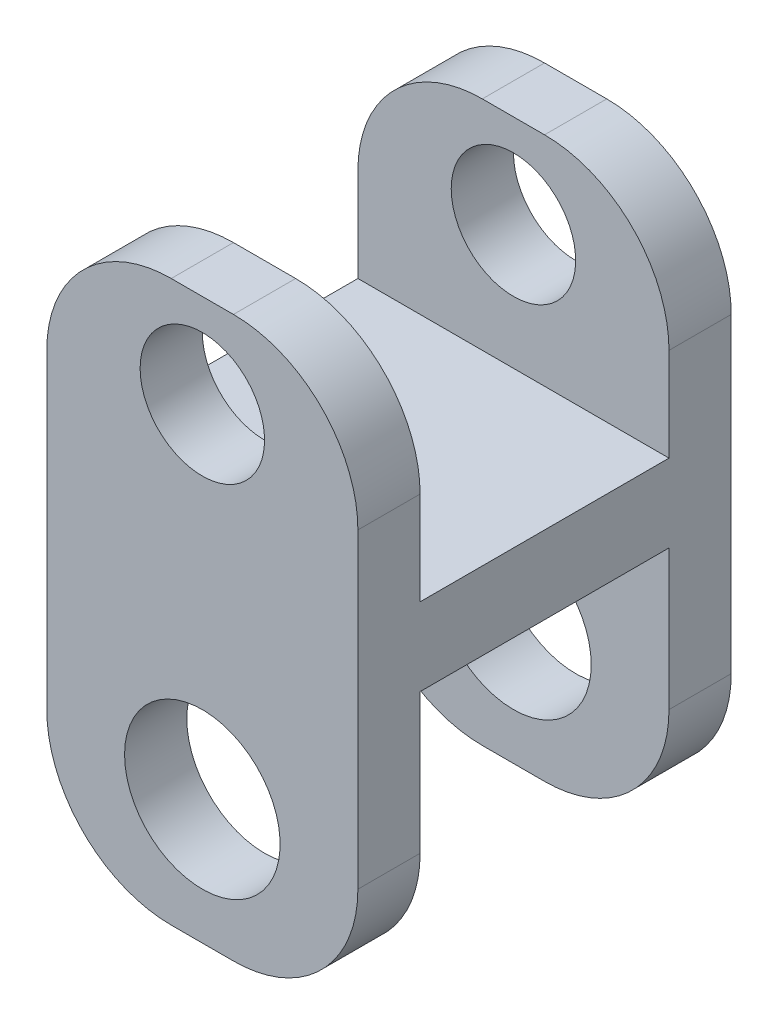
ISO-10303-21;
HEADER;
FILE_DESCRIPTION(('STEP AP214'),'2;1');
FILE_NAME('part.step','',(''),(''),'','','');
FILE_SCHEMA(('AUTOMOTIVE_DESIGN { 1 0 10303 214 1 1 1 1 }'));
ENDSEC;
DATA;
#1=APPLICATION_CONTEXT('core data for automotive mechanical design processes');
#2=APPLICATION_PROTOCOL_DEFINITION('international standard','automotive_design',2000,#1);
#3=PRODUCT_CONTEXT('',#1,'mechanical');
#4=PRODUCT('Part','Part','',(#3));
#5=PRODUCT_RELATED_PRODUCT_CATEGORY('part','',(#4));
#6=PRODUCT_DEFINITION_FORMATION('','',#4);
#7=PRODUCT_DEFINITION_CONTEXT('part definition',#1,'design');
#8=PRODUCT_DEFINITION('design','',#6,#7);
#9=PRODUCT_DEFINITION_SHAPE('','',#8);
#10=(LENGTH_UNIT() NAMED_UNIT(*) SI_UNIT(.MILLI.,.METRE.));
#11=(NAMED_UNIT(*) PLANE_ANGLE_UNIT() SI_UNIT($,.RADIAN.));
#12=(NAMED_UNIT(*) SI_UNIT($,.STERADIAN.) SOLID_ANGLE_UNIT());
#13=UNCERTAINTY_MEASURE_WITH_UNIT(LENGTH_MEASURE(1.E-05),#10,'distance_accuracy_value','');
#14=(GEOMETRIC_REPRESENTATION_CONTEXT(3) GLOBAL_UNCERTAINTY_ASSIGNED_CONTEXT((#13)) GLOBAL_UNIT_ASSIGNED_CONTEXT((#10,
#11,#12)) REPRESENTATION_CONTEXT('',''));
#15=CARTESIAN_POINT('',(0.,0.,0.));
#16=DIRECTION('',(0.,0.,1.));
#17=DIRECTION('',(1.,0.,0.));
#18=AXIS2_PLACEMENT_3D('',#15,#16,#17);
#19=CARTESIAN_POINT('',(5.,-9.,-6.));
#20=DIRECTION('',(0.,0.,1.));
#21=DIRECTION('',(1.,0.,0.));
#22=AXIS2_PLACEMENT_3D('',#19,#20,#21);
#23=PLANE('',#22);
#24=CARTESIAN_POINT('',(0.,6.,-6.));
#25=DIRECTION('',(0.,0.,-1.));
#26=DIRECTION('',(-1.,0.,0.));
#27=AXIS2_PLACEMENT_3D('',#24,#25,#26);
#28=CIRCLE('',#27,2.);
#29=CARTESIAN_POINT('',(-2.,6.,-6.));
#30=VERTEX_POINT('',#29);
#31=EDGE_CURVE('E446',#30,#30,#28,.T.);
#32=ORIENTED_EDGE('',*,*,#31,.F.);
#33=EDGE_LOOP('',(#32));
#34=FACE_BOUND('',#33,.T.);
#35=CARTESIAN_POINT('',(0.,-5.,-6.));
#36=DIRECTION('',(0.,0.,-1.));
#37=DIRECTION('',(-1.,0.,0.));
#38=AXIS2_PLACEMENT_3D('',#35,#36,#37);
#39=CIRCLE('',#38,2.5);
#40=CARTESIAN_POINT('',(-2.5,-5.,-6.));
#41=VERTEX_POINT('',#40);
#42=EDGE_CURVE('E438',#41,#41,#39,.T.);
#43=ORIENTED_EDGE('',*,*,#42,.F.);
#44=EDGE_LOOP('',(#43));
#45=FACE_BOUND('',#44,.T.);
#46=DIRECTION('',(0.,1.,0.));
#47=VECTOR('',#46,1.);
#48=CARTESIAN_POINT('',(-5.,-9.,-6.));
#49=LINE('',#48,#47);
#50=CARTESIAN_POINT('',(-5.,-5.,-6.));
#51=VERTEX_POINT('',#50);
#52=CARTESIAN_POINT('',(-5.,5.,-6.));
#53=VERTEX_POINT('',#52);
#54=EDGE_CURVE('E228',#51,#53,#49,.T.);
#55=ORIENTED_EDGE('',*,*,#54,.T.);
#56=CARTESIAN_POINT('',(-1.,5.,-6.));
#57=DIRECTION('',(0.,0.,1.));
#58=DIRECTION('',(1.,0.,0.));
#59=AXIS2_PLACEMENT_3D('',#56,#57,#58);
#60=CIRCLE('',#59,4.);
#61=CARTESIAN_POINT('',(-1.,9.,-6.));
#62=VERTEX_POINT('',#61);
#63=EDGE_CURVE('E358',#53,#62,#60,.F.);
#64=ORIENTED_EDGE('',*,*,#63,.T.);
#65=DIRECTION('',(-1.,0.,0.));
#66=VECTOR('',#65,1.);
#67=CARTESIAN_POINT('',(5.,9.,-6.));
#68=LINE('',#67,#66);
#69=CARTESIAN_POINT('',(1.,9.,-6.));
#70=VERTEX_POINT('',#69);
#71=EDGE_CURVE('E289',#70,#62,#68,.T.);
#72=ORIENTED_EDGE('',*,*,#71,.F.);
#73=CARTESIAN_POINT('',(1.,5.,-6.));
#74=DIRECTION('',(0.,0.,1.));
#75=DIRECTION('',(1.,0.,0.));
#76=AXIS2_PLACEMENT_3D('',#73,#74,#75);
#77=CIRCLE('',#76,4.);
#78=CARTESIAN_POINT('',(5.,5.,-6.));
#79=VERTEX_POINT('',#78);
#80=EDGE_CURVE('E355',#70,#79,#77,.F.);
#81=ORIENTED_EDGE('',*,*,#80,.T.);
#82=DIRECTION('',(0.,1.,0.));
#83=VECTOR('',#82,1.);
#84=CARTESIAN_POINT('',(5.,-9.,-6.));
#85=LINE('',#84,#83);
#86=CARTESIAN_POINT('',(5.,-5.,-6.));
#87=VERTEX_POINT('',#86);
#88=EDGE_CURVE('E189',#87,#79,#85,.T.);
#89=ORIENTED_EDGE('',*,*,#88,.F.);
#90=CARTESIAN_POINT('',(1.,-5.,-6.));
#91=DIRECTION('',(0.,0.,1.));
#92=DIRECTION('',(1.,0.,0.));
#93=AXIS2_PLACEMENT_3D('',#90,#91,#92);
#94=CIRCLE('',#93,4.);
#95=CARTESIAN_POINT('',(1.,-9.,-6.));
#96=VERTEX_POINT('',#95);
#97=EDGE_CURVE('E349',#87,#96,#94,.F.);
#98=ORIENTED_EDGE('',*,*,#97,.T.);
#99=DIRECTION('',(-1.,0.,0.));
#100=VECTOR('',#99,1.);
#101=CARTESIAN_POINT('',(5.,-9.,-6.));
#102=LINE('',#101,#100);
#103=CARTESIAN_POINT('',(-1.,-9.,-6.));
#104=VERTEX_POINT('',#103);
#105=EDGE_CURVE('E227',#96,#104,#102,.T.);
#106=ORIENTED_EDGE('',*,*,#105,.T.);
#107=CARTESIAN_POINT('',(-1.,-5.,-6.));
#108=DIRECTION('',(0.,0.,1.));
#109=DIRECTION('',(1.,0.,0.));
#110=AXIS2_PLACEMENT_3D('',#107,#108,#109);
#111=CIRCLE('',#110,4.);
#112=EDGE_CURVE('E352',#104,#51,#111,.F.);
#113=ORIENTED_EDGE('',*,*,#112,.T.);
#114=EDGE_LOOP('',(#55,#64,#72,#81,#89,#98,#106,#113));
#115=FACE_BOUND('',#114,.T.);
#116=ADVANCED_FACE('F39',(#34,#45,#115),#23,.F.);
#117=CARTESIAN_POINT('',(5.,9.,-4.));
#118=DIRECTION('',(0.,-1.,0.));
#119=DIRECTION('',(0.,0.,-1.));
#120=AXIS2_PLACEMENT_3D('',#117,#118,#119);
#121=PLANE('',#120);
#122=ORIENTED_EDGE('',*,*,#71,.T.);
#123=DIRECTION('',(0.,0.,1.));
#124=VECTOR('',#123,1.);
#125=CARTESIAN_POINT('',(-1.,9.,-4.));
#126=LINE('',#125,#124);
#127=CARTESIAN_POINT('',(-1.,9.,-4.));
#128=VERTEX_POINT('',#127);
#129=EDGE_CURVE('E339',#62,#128,#126,.T.);
#130=ORIENTED_EDGE('',*,*,#129,.T.);
#131=DIRECTION('',(-1.,0.,0.));
#132=VECTOR('',#131,1.);
#133=CARTESIAN_POINT('',(5.,9.,-4.));
#134=LINE('',#133,#132);
#135=CARTESIAN_POINT('',(1.,9.,-4.));
#136=VERTEX_POINT('',#135);
#137=EDGE_CURVE('E200',#136,#128,#134,.T.);
#138=ORIENTED_EDGE('',*,*,#137,.F.);
#139=DIRECTION('',(0.,0.,1.));
#140=VECTOR('',#139,1.);
#141=CARTESIAN_POINT('',(1.,9.,-4.));
#142=LINE('',#141,#140);
#143=EDGE_CURVE('E336',#136,#70,#142,.F.);
#144=ORIENTED_EDGE('',*,*,#143,.T.);
#145=EDGE_LOOP('',(#122,#130,#138,#144));
#146=FACE_BOUND('',#145,.T.);
#147=ADVANCED_FACE('F421',(#146),#121,.F.);
#148=CARTESIAN_POINT('',(5.,9.,-4.));
#149=DIRECTION('',(0.,0.,-1.));
#150=DIRECTION('',(0.,1.,0.));
#151=AXIS2_PLACEMENT_3D('',#148,#149,#150);
#152=PLANE('',#151);
#153=CARTESIAN_POINT('',(0.,6.,-4.));
#154=DIRECTION('',(0.,0.,-1.));
#155=DIRECTION('',(0.,1.,0.));
#156=AXIS2_PLACEMENT_3D('',#153,#154,#155);
#157=CIRCLE('',#156,2.);
#158=CARTESIAN_POINT('',(0.,8.,-4.));
#159=VERTEX_POINT('',#158);
#160=EDGE_CURVE('E232',#159,#159,#157,.T.);
#161=ORIENTED_EDGE('',*,*,#160,.T.);
#162=EDGE_LOOP('',(#161));
#163=FACE_BOUND('',#162,.T.);
#164=ORIENTED_EDGE('',*,*,#137,.T.);
#165=CARTESIAN_POINT('',(-1.,5.,-4.));
#166=DIRECTION('',(0.,0.,-1.));
#167=DIRECTION('',(0.,1.,0.));
#168=AXIS2_PLACEMENT_3D('',#165,#166,#167);
#169=CIRCLE('',#168,4.);
#170=CARTESIAN_POINT('',(-5.,5.,-4.));
#171=VERTEX_POINT('',#170);
#172=EDGE_CURVE('E346',#128,#171,#169,.F.);
#173=ORIENTED_EDGE('',*,*,#172,.T.);
#174=DIRECTION('',(0.,-1.,0.));
#175=VECTOR('',#174,1.);
#176=CARTESIAN_POINT('',(-5.,9.,-4.));
#177=LINE('',#176,#175);
#178=CARTESIAN_POINT('',(-5.,2.,-4.));
#179=VERTEX_POINT('',#178);
#180=EDGE_CURVE('E196',#171,#179,#177,.T.);
#181=ORIENTED_EDGE('',*,*,#180,.T.);
#182=DIRECTION('',(-1.,0.,0.));
#183=VECTOR('',#182,1.);
#184=CARTESIAN_POINT('',(5.,2.,-4.));
#185=LINE('',#184,#183);
#186=CARTESIAN_POINT('',(5.,2.,-4.));
#187=VERTEX_POINT('',#186);
#188=EDGE_CURVE('E192',#187,#179,#185,.T.);
#189=ORIENTED_EDGE('',*,*,#188,.F.);
#190=DIRECTION('',(0.,-1.,0.));
#191=VECTOR('',#190,1.);
#192=CARTESIAN_POINT('',(5.,9.,-4.));
#193=LINE('',#192,#191);
#194=CARTESIAN_POINT('',(5.,5.,-4.));
#195=VERTEX_POINT('',#194);
#196=EDGE_CURVE('E177',#195,#187,#193,.T.);
#197=ORIENTED_EDGE('',*,*,#196,.F.);
#198=CARTESIAN_POINT('',(1.,5.,-4.));
#199=DIRECTION('',(0.,0.,-1.));
#200=DIRECTION('',(0.,1.,0.));
#201=AXIS2_PLACEMENT_3D('',#198,#199,#200);
#202=CIRCLE('',#201,4.);
#203=EDGE_CURVE('E343',#195,#136,#202,.F.);
#204=ORIENTED_EDGE('',*,*,#203,.T.);
#205=EDGE_LOOP('',(#164,#173,#181,#189,#197,#204));
#206=FACE_BOUND('',#205,.T.);
#207=ADVANCED_FACE('F194',(#163,#206),#152,.F.);
#208=CARTESIAN_POINT('',(5.,2.,4.));
#209=DIRECTION('',(0.,-1.,0.));
#210=DIRECTION('',(0.,0.,-1.));
#211=AXIS2_PLACEMENT_3D('',#208,#209,#210);
#212=PLANE('',#211);
#213=DIRECTION('',(0.,0.,1.));
#214=VECTOR('',#213,1.);
#215=CARTESIAN_POINT('',(-5.,2.,4.));
#216=LINE('',#215,#214);
#217=CARTESIAN_POINT('',(-5.,2.,4.));
#218=VERTEX_POINT('',#217);
#219=EDGE_CURVE('E235',#179,#218,#216,.T.);
#220=ORIENTED_EDGE('',*,*,#219,.T.);
#221=DIRECTION('',(-1.,0.,0.));
#222=VECTOR('',#221,1.);
#223=CARTESIAN_POINT('',(5.,2.,4.));
#224=LINE('',#223,#222);
#225=CARTESIAN_POINT('',(5.,2.,4.));
#226=VERTEX_POINT('',#225);
#227=EDGE_CURVE('E201',#226,#218,#224,.T.);
#228=ORIENTED_EDGE('',*,*,#227,.F.);
#229=DIRECTION('',(0.,0.,1.));
#230=VECTOR('',#229,1.);
#231=CARTESIAN_POINT('',(5.,2.,4.));
#232=LINE('',#231,#230);
#233=EDGE_CURVE('E182',#187,#226,#232,.T.);
#234=ORIENTED_EDGE('',*,*,#233,.F.);
#235=ORIENTED_EDGE('',*,*,#188,.T.);
#236=EDGE_LOOP('',(#220,#228,#234,#235));
#237=FACE_BOUND('',#236,.T.);
#238=ADVANCED_FACE('F203',(#237),#212,.F.);
#239=CARTESIAN_POINT('',(5.,9.,4.));
#240=DIRECTION('',(0.,0.,1.));
#241=DIRECTION('',(0.,-1.,0.));
#242=AXIS2_PLACEMENT_3D('',#239,#240,#241);
#243=PLANE('',#242);
#244=CARTESIAN_POINT('',(0.,6.,4.));
#245=DIRECTION('',(0.,0.,1.));
#246=DIRECTION('',(0.,-1.,0.));
#247=AXIS2_PLACEMENT_3D('',#244,#245,#246);
#248=CIRCLE('',#247,2.);
#249=CARTESIAN_POINT('',(0.,4.,4.));
#250=VERTEX_POINT('',#249);
#251=EDGE_CURVE('E431',#250,#250,#248,.T.);
#252=ORIENTED_EDGE('',*,*,#251,.T.);
#253=EDGE_LOOP('',(#252));
#254=FACE_BOUND('',#253,.T.);
#255=DIRECTION('',(0.,1.,0.));
#256=VECTOR('',#255,1.);
#257=CARTESIAN_POINT('',(-5.,9.,4.));
#258=LINE('',#257,#256);
#259=CARTESIAN_POINT('',(-5.,5.,4.));
#260=VERTEX_POINT('',#259);
#261=EDGE_CURVE('E238',#218,#260,#258,.T.);
#262=ORIENTED_EDGE('',*,*,#261,.T.);
#263=CARTESIAN_POINT('',(-1.,5.,4.));
#264=DIRECTION('',(0.,0.,1.));
#265=DIRECTION('',(0.,-1.,0.));
#266=AXIS2_PLACEMENT_3D('',#263,#264,#265);
#267=CIRCLE('',#266,4.);
#268=CARTESIAN_POINT('',(-1.,9.,4.));
#269=VERTEX_POINT('',#268);
#270=EDGE_CURVE('E333',#260,#269,#267,.F.);
#271=ORIENTED_EDGE('',*,*,#270,.T.);
#272=DIRECTION('',(-1.,0.,0.));
#273=VECTOR('',#272,1.);
#274=CARTESIAN_POINT('',(5.,9.,4.));
#275=LINE('',#274,#273);
#276=CARTESIAN_POINT('',(1.,9.,4.));
#277=VERTEX_POINT('',#276);
#278=EDGE_CURVE('E281',#277,#269,#275,.T.);
#279=ORIENTED_EDGE('',*,*,#278,.F.);
#280=CARTESIAN_POINT('',(1.,5.,4.));
#281=DIRECTION('',(0.,0.,1.));
#282=DIRECTION('',(0.,-1.,0.));
#283=AXIS2_PLACEMENT_3D('',#280,#281,#282);
#284=CIRCLE('',#283,4.);
#285=CARTESIAN_POINT('',(5.,5.,4.));
#286=VERTEX_POINT('',#285);
#287=EDGE_CURVE('E330',#277,#286,#284,.F.);
#288=ORIENTED_EDGE('',*,*,#287,.T.);
#289=DIRECTION('',(0.,1.,0.));
#290=VECTOR('',#289,1.);
#291=CARTESIAN_POINT('',(5.,9.,4.));
#292=LINE('',#291,#290);
#293=EDGE_CURVE('E207',#226,#286,#292,.T.);
#294=ORIENTED_EDGE('',*,*,#293,.F.);
#295=ORIENTED_EDGE('',*,*,#227,.T.);
#296=EDGE_LOOP('',(#262,#271,#279,#288,#294,#295));
#297=FACE_BOUND('',#296,.T.);
#298=ADVANCED_FACE('F465',(#254,#297),#243,.F.);
#299=CARTESIAN_POINT('',(5.,9.,6.));
#300=DIRECTION('',(0.,-1.,0.));
#301=DIRECTION('',(0.,0.,-1.));
#302=AXIS2_PLACEMENT_3D('',#299,#300,#301);
#303=PLANE('',#302);
#304=ORIENTED_EDGE('',*,*,#278,.T.);
#305=DIRECTION('',(0.,0.,1.));
#306=VECTOR('',#305,1.);
#307=CARTESIAN_POINT('',(-1.,9.,6.));
#308=LINE('',#307,#306);
#309=CARTESIAN_POINT('',(-1.,9.,6.));
#310=VERTEX_POINT('',#309);
#311=EDGE_CURVE('E302',#269,#310,#308,.T.);
#312=ORIENTED_EDGE('',*,*,#311,.T.);
#313=DIRECTION('',(-1.,0.,0.));
#314=VECTOR('',#313,1.);
#315=CARTESIAN_POINT('',(5.,9.,6.));
#316=LINE('',#315,#314);
#317=CARTESIAN_POINT('',(1.,9.,6.));
#318=VERTEX_POINT('',#317);
#319=EDGE_CURVE('E277',#318,#310,#316,.T.);
#320=ORIENTED_EDGE('',*,*,#319,.F.);
#321=DIRECTION('',(0.,0.,1.));
#322=VECTOR('',#321,1.);
#323=CARTESIAN_POINT('',(1.,9.,6.));
#324=LINE('',#323,#322);
#325=EDGE_CURVE('E293',#318,#277,#324,.F.);
#326=ORIENTED_EDGE('',*,*,#325,.T.);
#327=EDGE_LOOP('',(#304,#312,#320,#326));
#328=FACE_BOUND('',#327,.T.);
#329=ADVANCED_FACE('F468',(#328),#303,.F.);
#330=CARTESIAN_POINT('',(5.,-9.,6.));
#331=DIRECTION('',(0.,0.,-1.));
#332=DIRECTION('',(-1.,0.,0.));
#333=AXIS2_PLACEMENT_3D('',#330,#331,#332);
#334=PLANE('',#333);
#335=CARTESIAN_POINT('',(0.,6.,6.));
#336=DIRECTION('',(0.,0.,-1.));
#337=DIRECTION('',(-1.,0.,0.));
#338=AXIS2_PLACEMENT_3D('',#335,#336,#337);
#339=CIRCLE('',#338,2.);
#340=CARTESIAN_POINT('',(-2.,6.,6.));
#341=VERTEX_POINT('',#340);
#342=EDGE_CURVE('E299',#341,#341,#339,.T.);
#343=ORIENTED_EDGE('',*,*,#342,.T.);
#344=EDGE_LOOP('',(#343));
#345=FACE_BOUND('',#344,.T.);
#346=CARTESIAN_POINT('',(0.,-5.,6.));
#347=DIRECTION('',(0.,0.,-1.));
#348=DIRECTION('',(-1.,0.,0.));
#349=AXIS2_PLACEMENT_3D('',#346,#347,#348);
#350=CIRCLE('',#349,2.5);
#351=CARTESIAN_POINT('',(-2.5,-5.,6.));
#352=VERTEX_POINT('',#351);
#353=EDGE_CURVE('E442',#352,#352,#350,.T.);
#354=ORIENTED_EDGE('',*,*,#353,.T.);
#355=EDGE_LOOP('',(#354));
#356=FACE_BOUND('',#355,.T.);
#357=ORIENTED_EDGE('',*,*,#319,.T.);
#358=CARTESIAN_POINT('',(-1.,5.,6.));
#359=DIRECTION('',(0.,0.,-1.));
#360=DIRECTION('',(-1.,0.,0.));
#361=AXIS2_PLACEMENT_3D('',#358,#359,#360);
#362=CIRCLE('',#361,4.);
#363=CARTESIAN_POINT('',(-5.,5.,6.));
#364=VERTEX_POINT('',#363);
#365=EDGE_CURVE('E315',#310,#364,#362,.F.);
#366=ORIENTED_EDGE('',*,*,#365,.T.);
#367=DIRECTION('',(0.,-1.,0.));
#368=VECTOR('',#367,1.);
#369=CARTESIAN_POINT('',(-5.,-9.,6.));
#370=LINE('',#369,#368);
#371=CARTESIAN_POINT('',(-5.,-5.,6.));
#372=VERTEX_POINT('',#371);
#373=EDGE_CURVE('E242',#364,#372,#370,.T.);
#374=ORIENTED_EDGE('',*,*,#373,.T.);
#375=CARTESIAN_POINT('',(-1.,-5.,6.));
#376=DIRECTION('',(0.,0.,-1.));
#377=DIRECTION('',(-1.,0.,0.));
#378=AXIS2_PLACEMENT_3D('',#375,#376,#377);
#379=CIRCLE('',#378,4.);
#380=CARTESIAN_POINT('',(-1.,-9.,6.));
#381=VERTEX_POINT('',#380);
#382=EDGE_CURVE('E306',#372,#381,#379,.F.);
#383=ORIENTED_EDGE('',*,*,#382,.T.);
#384=DIRECTION('',(-1.,0.,0.));
#385=VECTOR('',#384,1.);
#386=CARTESIAN_POINT('',(5.,-9.,6.));
#387=LINE('',#386,#385);
#388=CARTESIAN_POINT('',(1.,-9.,6.));
#389=VERTEX_POINT('',#388);
#390=EDGE_CURVE('E273',#389,#381,#387,.T.);
#391=ORIENTED_EDGE('',*,*,#390,.F.);
#392=CARTESIAN_POINT('',(1.,-5.,6.));
#393=DIRECTION('',(0.,0.,-1.));
#394=DIRECTION('',(-1.,0.,0.));
#395=AXIS2_PLACEMENT_3D('',#392,#393,#394);
#396=CIRCLE('',#395,4.);
#397=CARTESIAN_POINT('',(5.,-5.,6.));
#398=VERTEX_POINT('',#397);
#399=EDGE_CURVE('E309',#389,#398,#396,.F.);
#400=ORIENTED_EDGE('',*,*,#399,.T.);
#401=DIRECTION('',(0.,-1.,0.));
#402=VECTOR('',#401,1.);
#403=CARTESIAN_POINT('',(5.,-9.,6.));
#404=LINE('',#403,#402);
#405=CARTESIAN_POINT('',(5.,5.,6.));
#406=VERTEX_POINT('',#405);
#407=EDGE_CURVE('E210',#406,#398,#404,.T.);
#408=ORIENTED_EDGE('',*,*,#407,.F.);
#409=CARTESIAN_POINT('',(1.,5.,6.));
#410=DIRECTION('',(0.,0.,-1.));
#411=DIRECTION('',(-1.,0.,0.));
#412=AXIS2_PLACEMENT_3D('',#409,#410,#411);
#413=CIRCLE('',#412,4.);
#414=EDGE_CURVE('E312',#406,#318,#413,.F.);
#415=ORIENTED_EDGE('',*,*,#414,.T.);
#416=EDGE_LOOP('',(#357,#366,#374,#383,#391,#400,#408,#415));
#417=FACE_BOUND('',#416,.T.);
#418=ADVANCED_FACE('F454',(#345,#356,#417),#334,.F.);
#419=CARTESIAN_POINT('',(5.,-9.,6.));
#420=DIRECTION('',(0.,1.,0.));
#421=DIRECTION('',(0.,0.,1.));
#422=AXIS2_PLACEMENT_3D('',#419,#420,#421);
#423=PLANE('',#422);
#424=DIRECTION('',(-1.,0.,0.));
#425=VECTOR('',#424,1.);
#426=CARTESIAN_POINT('',(5.,-9.,4.));
#427=LINE('',#426,#425);
#428=CARTESIAN_POINT('',(1.,-9.,4.));
#429=VERTEX_POINT('',#428);
#430=CARTESIAN_POINT('',(-1.,-9.,4.));
#431=VERTEX_POINT('',#430);
#432=EDGE_CURVE('E269',#429,#431,#427,.T.);
#433=ORIENTED_EDGE('',*,*,#432,.F.);
#434=DIRECTION('',(0.,0.,-1.));
#435=VECTOR('',#434,1.);
#436=CARTESIAN_POINT('',(1.,-9.,6.));
#437=LINE('',#436,#435);
#438=EDGE_CURVE('E385',#429,#389,#437,.F.);
#439=ORIENTED_EDGE('',*,*,#438,.T.);
#440=ORIENTED_EDGE('',*,*,#390,.T.);
#441=DIRECTION('',(0.,0.,-1.));
#442=VECTOR('',#441,1.);
#443=CARTESIAN_POINT('',(-1.,-9.,4.));
#444=LINE('',#443,#442);
#445=EDGE_CURVE('E381',#381,#431,#444,.T.);
#446=ORIENTED_EDGE('',*,*,#445,.T.);
#447=EDGE_LOOP('',(#433,#439,#440,#446));
#448=FACE_BOUND('',#447,.T.);
#449=ADVANCED_FACE('F497',(#448),#423,.F.);
#450=CARTESIAN_POINT('',(5.,-9.,4.));
#451=DIRECTION('',(0.,0.,1.));
#452=DIRECTION('',(1.,0.,0.));
#453=AXIS2_PLACEMENT_3D('',#450,#451,#452);
#454=PLANE('',#453);
#455=CARTESIAN_POINT('',(0.,-5.,4.));
#456=DIRECTION('',(0.,0.,1.));
#457=DIRECTION('',(1.,0.,0.));
#458=AXIS2_PLACEMENT_3D('',#455,#456,#457);
#459=CIRCLE('',#458,2.5);
#460=CARTESIAN_POINT('',(2.5,-5.,4.));
#461=VERTEX_POINT('',#460);
#462=EDGE_CURVE('E298',#461,#461,#459,.T.);
#463=ORIENTED_EDGE('',*,*,#462,.T.);
#464=EDGE_LOOP('',(#463));
#465=FACE_BOUND('',#464,.T.);
#466=DIRECTION('',(0.,1.,0.));
#467=VECTOR('',#466,1.);
#468=CARTESIAN_POINT('',(5.,-9.,4.));
#469=LINE('',#468,#467);
#470=CARTESIAN_POINT('',(5.,-5.,4.));
#471=VERTEX_POINT('',#470);
#472=CARTESIAN_POINT('',(5.,-0.500000000000001,4.));
#473=VERTEX_POINT('',#472);
#474=EDGE_CURVE('E217',#471,#473,#469,.T.);
#475=ORIENTED_EDGE('',*,*,#474,.F.);
#476=CARTESIAN_POINT('',(1.,-5.,4.));
#477=DIRECTION('',(0.,0.,1.));
#478=DIRECTION('',(1.,0.,0.));
#479=AXIS2_PLACEMENT_3D('',#476,#477,#478);
#480=CIRCLE('',#479,4.);
#481=EDGE_CURVE('E378',#471,#429,#480,.F.);
#482=ORIENTED_EDGE('',*,*,#481,.T.);
#483=ORIENTED_EDGE('',*,*,#432,.T.);
#484=CARTESIAN_POINT('',(-1.,-5.,4.));
#485=DIRECTION('',(0.,0.,1.));
#486=DIRECTION('',(1.,0.,0.));
#487=AXIS2_PLACEMENT_3D('',#484,#485,#486);
#488=CIRCLE('',#487,4.);
#489=CARTESIAN_POINT('',(-5.,-5.,4.));
#490=VERTEX_POINT('',#489);
#491=EDGE_CURVE('E375',#431,#490,#488,.F.);
#492=ORIENTED_EDGE('',*,*,#491,.T.);
#493=DIRECTION('',(0.,1.,0.));
#494=VECTOR('',#493,1.);
#495=CARTESIAN_POINT('',(-5.,-9.,4.));
#496=LINE('',#495,#494);
#497=CARTESIAN_POINT('',(-5.,-0.500000000000001,4.));
#498=VERTEX_POINT('',#497);
#499=EDGE_CURVE('E246',#490,#498,#496,.T.);
#500=ORIENTED_EDGE('',*,*,#499,.T.);
#501=DIRECTION('',(-1.,0.,0.));
#502=VECTOR('',#501,1.);
#503=CARTESIAN_POINT('',(5.,-0.500000000000001,4.));
#504=LINE('',#503,#502);
#505=EDGE_CURVE('E265',#473,#498,#504,.T.);
#506=ORIENTED_EDGE('',*,*,#505,.F.);
#507=EDGE_LOOP('',(#475,#482,#483,#492,#500,#506));
#508=FACE_BOUND('',#507,.T.);
#509=ADVANCED_FACE('F494',(#465,#508),#454,.F.);
#510=CARTESIAN_POINT('',(5.,-0.500000000000001,4.));
#511=DIRECTION('',(0.,1.,0.));
#512=DIRECTION('',(0.,0.,1.));
#513=AXIS2_PLACEMENT_3D('',#510,#511,#512);
#514=PLANE('',#513);
#515=DIRECTION('',(0.,0.,-1.));
#516=VECTOR('',#515,1.);
#517=CARTESIAN_POINT('',(-5.,-0.500000000000001,4.));
#518=LINE('',#517,#516);
#519=CARTESIAN_POINT('',(-5.,-0.500000000000001,-4.));
#520=VERTEX_POINT('',#519);
#521=EDGE_CURVE('E249',#498,#520,#518,.T.);
#522=ORIENTED_EDGE('',*,*,#521,.T.);
#523=DIRECTION('',(-1.,0.,0.));
#524=VECTOR('',#523,1.);
#525=CARTESIAN_POINT('',(5.,-0.500000000000001,-4.));
#526=LINE('',#525,#524);
#527=CARTESIAN_POINT('',(5.,-0.500000000000001,-4.));
#528=VERTEX_POINT('',#527);
#529=EDGE_CURVE('E261',#528,#520,#526,.T.);
#530=ORIENTED_EDGE('',*,*,#529,.F.);
#531=DIRECTION('',(0.,0.,-1.));
#532=VECTOR('',#531,1.);
#533=CARTESIAN_POINT('',(5.,-0.500000000000001,4.));
#534=LINE('',#533,#532);
#535=EDGE_CURVE('E220',#473,#528,#534,.T.);
#536=ORIENTED_EDGE('',*,*,#535,.F.);
#537=ORIENTED_EDGE('',*,*,#505,.T.);
#538=EDGE_LOOP('',(#522,#530,#536,#537));
#539=FACE_BOUND('',#538,.T.);
#540=ADVANCED_FACE('F507',(#539),#514,.F.);
#541=CARTESIAN_POINT('',(5.,-9.,-4.));
#542=DIRECTION('',(0.,0.,-1.));
#543=DIRECTION('',(0.,1.,0.));
#544=AXIS2_PLACEMENT_3D('',#541,#542,#543);
#545=PLANE('',#544);
#546=CARTESIAN_POINT('',(0.,-5.,-4.));
#547=DIRECTION('',(0.,0.,-1.));
#548=DIRECTION('',(0.,1.,0.));
#549=AXIS2_PLACEMENT_3D('',#546,#547,#548);
#550=CIRCLE('',#549,2.5);
#551=CARTESIAN_POINT('',(0.,-2.5,-4.));
#552=VERTEX_POINT('',#551);
#553=EDGE_CURVE('E294',#552,#552,#550,.T.);
#554=ORIENTED_EDGE('',*,*,#553,.T.);
#555=EDGE_LOOP('',(#554));
#556=FACE_BOUND('',#555,.T.);
#557=DIRECTION('',(0.,-1.,0.));
#558=VECTOR('',#557,1.);
#559=CARTESIAN_POINT('',(-5.,-9.,-4.));
#560=LINE('',#559,#558);
#561=CARTESIAN_POINT('',(-5.,-5.,-4.));
#562=VERTEX_POINT('',#561);
#563=EDGE_CURVE('E252',#520,#562,#560,.T.);
#564=ORIENTED_EDGE('',*,*,#563,.T.);
#565=CARTESIAN_POINT('',(-1.,-5.,-4.));
#566=DIRECTION('',(0.,0.,-1.));
#567=DIRECTION('',(0.,1.,0.));
#568=AXIS2_PLACEMENT_3D('',#565,#566,#567);
#569=CIRCLE('',#568,4.);
#570=CARTESIAN_POINT('',(-1.,-9.,-4.));
#571=VERTEX_POINT('',#570);
#572=EDGE_CURVE('E11',#562,#571,#569,.F.);
#573=ORIENTED_EDGE('',*,*,#572,.T.);
#574=DIRECTION('',(-1.,0.,0.));
#575=VECTOR('',#574,1.);
#576=CARTESIAN_POINT('',(5.,-9.,-4.));
#577=LINE('',#576,#575);
#578=CARTESIAN_POINT('',(1.,-9.,-4.));
#579=VERTEX_POINT('',#578);
#580=EDGE_CURVE('E258',#579,#571,#577,.T.);
#581=ORIENTED_EDGE('',*,*,#580,.F.);
#582=CARTESIAN_POINT('',(1.,-5.,-4.));
#583=DIRECTION('',(0.,0.,-1.));
#584=DIRECTION('',(0.,1.,0.));
#585=AXIS2_PLACEMENT_3D('',#582,#583,#584);
#586=CIRCLE('',#585,4.);
#587=CARTESIAN_POINT('',(5.,-5.,-4.));
#588=VERTEX_POINT('',#587);
#589=EDGE_CURVE('E48',#579,#588,#586,.F.);
#590=ORIENTED_EDGE('',*,*,#589,.T.);
#591=DIRECTION('',(0.,-1.,0.));
#592=VECTOR('',#591,1.);
#593=CARTESIAN_POINT('',(5.,-9.,-4.));
#594=LINE('',#593,#592);
#595=EDGE_CURVE('E223',#528,#588,#594,.T.);
#596=ORIENTED_EDGE('',*,*,#595,.F.);
#597=ORIENTED_EDGE('',*,*,#529,.T.);
#598=EDGE_LOOP('',(#564,#573,#581,#590,#596,#597));
#599=FACE_BOUND('',#598,.T.);
#600=ADVANCED_FACE('F396',(#556,#599),#545,.F.);
#601=CARTESIAN_POINT('',(5.,-9.,-4.));
#602=DIRECTION('',(0.,1.,0.));
#603=DIRECTION('',(0.,0.,1.));
#604=AXIS2_PLACEMENT_3D('',#601,#602,#603);
#605=PLANE('',#604);
#606=ORIENTED_EDGE('',*,*,#580,.T.);
#607=DIRECTION('',(0.,0.,-1.));
#608=VECTOR('',#607,1.);
#609=CARTESIAN_POINT('',(-1.,-9.,-6.));
#610=LINE('',#609,#608);
#611=EDGE_CURVE('E390',#571,#104,#610,.T.);
#612=ORIENTED_EDGE('',*,*,#611,.T.);
#613=ORIENTED_EDGE('',*,*,#105,.F.);
#614=DIRECTION('',(0.,0.,-1.));
#615=VECTOR('',#614,1.);
#616=CARTESIAN_POINT('',(1.,-9.,-4.));
#617=LINE('',#616,#615);
#618=EDGE_CURVE('E60',#96,#579,#617,.F.);
#619=ORIENTED_EDGE('',*,*,#618,.T.);
#620=EDGE_LOOP('',(#606,#612,#613,#619));
#621=FACE_BOUND('',#620,.T.);
#622=ADVANCED_FACE('F403',(#621),#605,.F.);
#623=CARTESIAN_POINT('',(5.,0.,0.));
#624=DIRECTION('',(-1.,0.,0.));
#625=DIRECTION('',(0.,0.,1.));
#626=AXIS2_PLACEMENT_3D('',#623,#624,#625);
#627=PLANE('',#626);
#628=ORIENTED_EDGE('',*,*,#293,.T.);
#629=DIRECTION('',(0.,0.,1.));
#630=VECTOR('',#629,1.);
#631=CARTESIAN_POINT('',(5.,5.,0.));
#632=LINE('',#631,#630);
#633=EDGE_CURVE('E371',#286,#406,#632,.T.);
#634=ORIENTED_EDGE('',*,*,#633,.T.);
#635=ORIENTED_EDGE('',*,*,#407,.T.);
#636=DIRECTION('',(0.,0.,-1.));
#637=VECTOR('',#636,1.);
#638=CARTESIAN_POINT('',(5.,-5.,0.));
#639=LINE('',#638,#637);
#640=EDGE_CURVE('E365',#398,#471,#639,.T.);
#641=ORIENTED_EDGE('',*,*,#640,.T.);
#642=ORIENTED_EDGE('',*,*,#474,.T.);
#643=ORIENTED_EDGE('',*,*,#535,.T.);
#644=ORIENTED_EDGE('',*,*,#595,.T.);
#645=DIRECTION('',(0.,0.,-1.));
#646=VECTOR('',#645,1.);
#647=CARTESIAN_POINT('',(5.,-5.,0.));
#648=LINE('',#647,#646);
#649=EDGE_CURVE('E361',#588,#87,#648,.T.);
#650=ORIENTED_EDGE('',*,*,#649,.T.);
#651=ORIENTED_EDGE('',*,*,#88,.T.);
#652=DIRECTION('',(0.,0.,1.));
#653=VECTOR('',#652,1.);
#654=CARTESIAN_POINT('',(5.,5.,0.));
#655=LINE('',#654,#653);
#656=EDGE_CURVE('E186',#79,#195,#655,.T.);
#657=ORIENTED_EDGE('',*,*,#656,.T.);
#658=ORIENTED_EDGE('',*,*,#196,.T.);
#659=ORIENTED_EDGE('',*,*,#233,.T.);
#660=EDGE_LOOP('',(#628,#634,#635,#641,#642,#643,#644,#650,#651,#657,#658,#659));
#661=FACE_BOUND('',#660,.T.);
#662=ADVANCED_FACE('F180',(#661),#627,.F.);
#663=CARTESIAN_POINT('',(-5.,0.,0.));
#664=DIRECTION('',(-1.,0.,0.));
#665=DIRECTION('',(0.,0.,1.));
#666=AXIS2_PLACEMENT_3D('',#663,#664,#665);
#667=PLANE('',#666);
#668=ORIENTED_EDGE('',*,*,#373,.F.);
#669=DIRECTION('',(0.,0.,1.));
#670=VECTOR('',#669,1.);
#671=CARTESIAN_POINT('',(-5.,5.,4.));
#672=LINE('',#671,#670);
#673=EDGE_CURVE('E327',#364,#260,#672,.F.);
#674=ORIENTED_EDGE('',*,*,#673,.T.);
#675=ORIENTED_EDGE('',*,*,#261,.F.);
#676=ORIENTED_EDGE('',*,*,#219,.F.);
#677=ORIENTED_EDGE('',*,*,#180,.F.);
#678=DIRECTION('',(0.,0.,1.));
#679=VECTOR('',#678,1.);
#680=CARTESIAN_POINT('',(-5.,5.,-6.));
#681=LINE('',#680,#679);
#682=EDGE_CURVE('E324',#171,#53,#681,.F.);
#683=ORIENTED_EDGE('',*,*,#682,.T.);
#684=ORIENTED_EDGE('',*,*,#54,.F.);
#685=DIRECTION('',(0.,0.,-1.));
#686=VECTOR('',#685,1.);
#687=CARTESIAN_POINT('',(-5.,-5.,-4.));
#688=LINE('',#687,#686);
#689=EDGE_CURVE('E318',#51,#562,#688,.F.);
#690=ORIENTED_EDGE('',*,*,#689,.T.);
#691=ORIENTED_EDGE('',*,*,#563,.F.);
#692=ORIENTED_EDGE('',*,*,#521,.F.);
#693=ORIENTED_EDGE('',*,*,#499,.F.);
#694=DIRECTION('',(0.,0.,-1.));
#695=VECTOR('',#694,1.);
#696=CARTESIAN_POINT('',(-5.,-5.,6.));
#697=LINE('',#696,#695);
#698=EDGE_CURVE('E321',#490,#372,#697,.F.);
#699=ORIENTED_EDGE('',*,*,#698,.T.);
#700=EDGE_LOOP('',(#668,#674,#675,#676,#677,#683,#684,#690,#691,#692,#693,#699));
#701=FACE_BOUND('',#700,.T.);
#702=ADVANCED_FACE('F412',(#701),#667,.T.);
#703=CARTESIAN_POINT('',(0.,-5.,6.));
#704=DIRECTION('',(0.,0.,-1.));
#705=DIRECTION('',(-1.,0.,0.));
#706=AXIS2_PLACEMENT_3D('',#703,#704,#705);
#707=CYLINDRICAL_SURFACE('',#706,2.5);
#708=ORIENTED_EDGE('',*,*,#42,.T.);
#709=EDGE_LOOP('',(#708));
#710=FACE_BOUND('',#709,.T.);
#711=ORIENTED_EDGE('',*,*,#553,.F.);
#712=EDGE_LOOP('',(#711));
#713=FACE_BOUND('',#712,.T.);
#714=ADVANCED_FACE('F597',(#710,#713),#707,.F.);
#715=ORIENTED_EDGE('',*,*,#353,.F.);
#716=EDGE_LOOP('',(#715));
#717=FACE_BOUND('',#716,.T.);
#718=ORIENTED_EDGE('',*,*,#462,.F.);
#719=EDGE_LOOP('',(#718));
#720=FACE_BOUND('',#719,.T.);
#721=ADVANCED_FACE('F461',(#717,#720),#707,.F.);
#722=CARTESIAN_POINT('',(0.,6.,6.));
#723=DIRECTION('',(0.,0.,-1.));
#724=DIRECTION('',(-1.,0.,0.));
#725=AXIS2_PLACEMENT_3D('',#722,#723,#724);
#726=CYLINDRICAL_SURFACE('',#725,2.);
#727=ORIENTED_EDGE('',*,*,#342,.F.);
#728=EDGE_LOOP('',(#727));
#729=FACE_BOUND('',#728,.T.);
#730=ORIENTED_EDGE('',*,*,#251,.F.);
#731=EDGE_LOOP('',(#730));
#732=FACE_BOUND('',#731,.T.);
#733=ADVANCED_FACE('F457',(#729,#732),#726,.F.);
#734=ORIENTED_EDGE('',*,*,#31,.T.);
#735=EDGE_LOOP('',(#734));
#736=FACE_BOUND('',#735,.T.);
#737=ORIENTED_EDGE('',*,*,#160,.F.);
#738=EDGE_LOOP('',(#737));
#739=FACE_BOUND('',#738,.T.);
#740=ADVANCED_FACE('F460',(#736,#739),#726,.F.);
#741=CARTESIAN_POINT('',(-1.,5.,6.));
#742=DIRECTION('',(0.,0.,-1.));
#743=DIRECTION('',(-1.,0.,0.));
#744=AXIS2_PLACEMENT_3D('',#741,#742,#743);
#745=CYLINDRICAL_SURFACE('',#744,4.);
#746=ORIENTED_EDGE('',*,*,#270,.F.);
#747=ORIENTED_EDGE('',*,*,#673,.F.);
#748=ORIENTED_EDGE('',*,*,#365,.F.);
#749=ORIENTED_EDGE('',*,*,#311,.F.);
#750=EDGE_LOOP('',(#746,#747,#748,#749));
#751=FACE_BOUND('',#750,.T.);
#752=ADVANCED_FACE('F476',(#751),#745,.T.);
#753=CARTESIAN_POINT('',(-1.,5.,-4.));
#754=DIRECTION('',(0.,0.,-1.));
#755=DIRECTION('',(-1.,0.,0.));
#756=AXIS2_PLACEMENT_3D('',#753,#754,#755);
#757=CYLINDRICAL_SURFACE('',#756,4.);
#758=ORIENTED_EDGE('',*,*,#63,.F.);
#759=ORIENTED_EDGE('',*,*,#682,.F.);
#760=ORIENTED_EDGE('',*,*,#172,.F.);
#761=ORIENTED_EDGE('',*,*,#129,.F.);
#762=EDGE_LOOP('',(#758,#759,#760,#761));
#763=FACE_BOUND('',#762,.T.);
#764=ADVANCED_FACE('F416',(#763),#757,.T.);
#765=CARTESIAN_POINT('',(1.,5.,0.));
#766=DIRECTION('',(0.,0.,1.));
#767=DIRECTION('',(1.,0.,0.));
#768=AXIS2_PLACEMENT_3D('',#765,#766,#767);
#769=CYLINDRICAL_SURFACE('',#768,4.);
#770=ORIENTED_EDGE('',*,*,#287,.F.);
#771=ORIENTED_EDGE('',*,*,#325,.F.);
#772=ORIENTED_EDGE('',*,*,#414,.F.);
#773=ORIENTED_EDGE('',*,*,#633,.F.);
#774=EDGE_LOOP('',(#770,#771,#772,#773));
#775=FACE_BOUND('',#774,.T.);
#776=ADVANCED_FACE('F485',(#775),#769,.T.);
#777=CARTESIAN_POINT('',(1.,5.,0.));
#778=DIRECTION('',(0.,0.,1.));
#779=DIRECTION('',(1.,0.,0.));
#780=AXIS2_PLACEMENT_3D('',#777,#778,#779);
#781=CYLINDRICAL_SURFACE('',#780,4.);
#782=ORIENTED_EDGE('',*,*,#80,.F.);
#783=ORIENTED_EDGE('',*,*,#143,.F.);
#784=ORIENTED_EDGE('',*,*,#203,.F.);
#785=ORIENTED_EDGE('',*,*,#656,.F.);
#786=EDGE_LOOP('',(#782,#783,#784,#785));
#787=FACE_BOUND('',#786,.T.);
#788=ADVANCED_FACE('F425',(#787),#781,.T.);
#789=CARTESIAN_POINT('',(1.,-5.,0.));
#790=DIRECTION('',(0.,0.,-1.));
#791=DIRECTION('',(-1.,0.,0.));
#792=AXIS2_PLACEMENT_3D('',#789,#790,#791);
#793=CYLINDRICAL_SURFACE('',#792,4.);
#794=ORIENTED_EDGE('',*,*,#399,.F.);
#795=ORIENTED_EDGE('',*,*,#438,.F.);
#796=ORIENTED_EDGE('',*,*,#481,.F.);
#797=ORIENTED_EDGE('',*,*,#640,.F.);
#798=EDGE_LOOP('',(#794,#795,#796,#797));
#799=FACE_BOUND('',#798,.T.);
#800=ADVANCED_FACE('F490',(#799),#793,.T.);
#801=CARTESIAN_POINT('',(-1.,-5.,6.));
#802=DIRECTION('',(0.,0.,1.));
#803=DIRECTION('',(1.,0.,0.));
#804=AXIS2_PLACEMENT_3D('',#801,#802,#803);
#805=CYLINDRICAL_SURFACE('',#804,4.);
#806=ORIENTED_EDGE('',*,*,#382,.F.);
#807=ORIENTED_EDGE('',*,*,#698,.F.);
#808=ORIENTED_EDGE('',*,*,#491,.F.);
#809=ORIENTED_EDGE('',*,*,#445,.F.);
#810=EDGE_LOOP('',(#806,#807,#808,#809));
#811=FACE_BOUND('',#810,.T.);
#812=ADVANCED_FACE('F502',(#811),#805,.T.);
#813=CARTESIAN_POINT('',(-1.,-5.,-4.));
#814=DIRECTION('',(0.,0.,1.));
#815=DIRECTION('',(1.,0.,0.));
#816=AXIS2_PLACEMENT_3D('',#813,#814,#815);
#817=CYLINDRICAL_SURFACE('',#816,4.);
#818=ORIENTED_EDGE('',*,*,#572,.F.);
#819=ORIENTED_EDGE('',*,*,#689,.F.);
#820=ORIENTED_EDGE('',*,*,#112,.F.);
#821=ORIENTED_EDGE('',*,*,#611,.F.);
#822=EDGE_LOOP('',(#818,#819,#820,#821));
#823=FACE_BOUND('',#822,.T.);
#824=ADVANCED_FACE('F406',(#823),#817,.T.);
#825=CARTESIAN_POINT('',(1.,-5.,0.));
#826=DIRECTION('',(0.,0.,-1.));
#827=DIRECTION('',(-1.,0.,0.));
#828=AXIS2_PLACEMENT_3D('',#825,#826,#827);
#829=CYLINDRICAL_SURFACE('',#828,4.);
#830=ORIENTED_EDGE('',*,*,#589,.F.);
#831=ORIENTED_EDGE('',*,*,#618,.F.);
#832=ORIENTED_EDGE('',*,*,#97,.F.);
#833=ORIENTED_EDGE('',*,*,#649,.F.);
#834=EDGE_LOOP('',(#830,#831,#832,#833));
#835=FACE_BOUND('',#834,.T.);
#836=ADVANCED_FACE('F41',(#835),#829,.T.);
#837=CLOSED_SHELL('',(#116,#147,#207,#238,#298,#329,#418,#449,#509,#540,#600,#622,#662,#702,
#714,#721,#733,#740,#752,#764,#776,#788,#800,#812,#824,#836));
#838=MANIFOLD_SOLID_BREP('B2',#837);
#839=ADVANCED_BREP_SHAPE_REPRESENTATION('',(#18,#838),#14);
#840=SHAPE_DEFINITION_REPRESENTATION(#9,#839);
ENDSEC;
END-ISO-10303-21;
